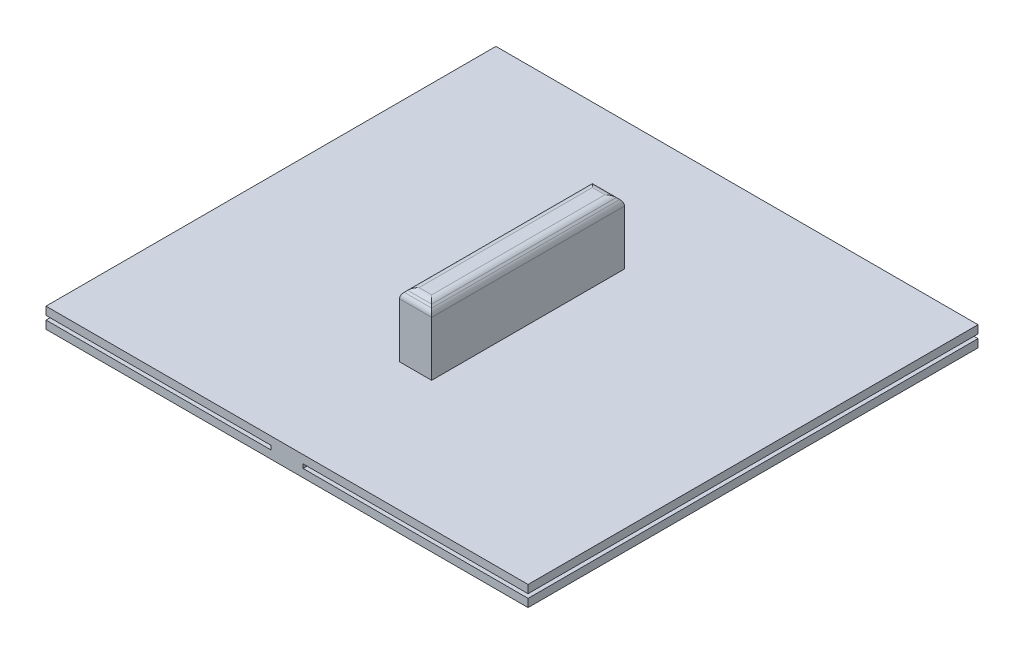
ISO-10303-21;
HEADER;
FILE_DESCRIPTION(('STEP AP214'),'2;1');
FILE_NAME('part.step','',(''),(''),'','','');
FILE_SCHEMA(('AUTOMOTIVE_DESIGN { 1 0 10303 214 1 1 1 1 }'));
ENDSEC;
DATA;
#1=APPLICATION_CONTEXT('core data for automotive mechanical design processes');
#2=APPLICATION_PROTOCOL_DEFINITION('international standard','automotive_design',2000,#1);
#3=PRODUCT_CONTEXT('',#1,'mechanical');
#4=PRODUCT('Part','Part','',(#3));
#5=PRODUCT_RELATED_PRODUCT_CATEGORY('part','',(#4));
#6=PRODUCT_DEFINITION_FORMATION('','',#4);
#7=PRODUCT_DEFINITION_CONTEXT('part definition',#1,'design');
#8=PRODUCT_DEFINITION('design','',#6,#7);
#9=PRODUCT_DEFINITION_SHAPE('','',#8);
#10=(LENGTH_UNIT() NAMED_UNIT(*) SI_UNIT(.MILLI.,.METRE.));
#11=(NAMED_UNIT(*) PLANE_ANGLE_UNIT() SI_UNIT($,.RADIAN.));
#12=(NAMED_UNIT(*) SI_UNIT($,.STERADIAN.) SOLID_ANGLE_UNIT());
#13=UNCERTAINTY_MEASURE_WITH_UNIT(LENGTH_MEASURE(1.E-05),#10,'distance_accuracy_value','');
#14=(GEOMETRIC_REPRESENTATION_CONTEXT(3) GLOBAL_UNCERTAINTY_ASSIGNED_CONTEXT((#13)) GLOBAL_UNIT_ASSIGNED_CONTEXT((#10,
#11,#12)) REPRESENTATION_CONTEXT('',''));
#15=CARTESIAN_POINT('',(0.,0.,0.));
#16=DIRECTION('',(0.,0.,1.));
#17=DIRECTION('',(1.,0.,0.));
#18=AXIS2_PLACEMENT_3D('',#15,#16,#17);
#19=CARTESIAN_POINT('',(-1.27,5.3975,-35.56));
#20=DIRECTION('',(-1.,0.,0.));
#21=DIRECTION('',(0.,-1.,0.));
#22=AXIS2_PLACEMENT_3D('',#19,#20,#21);
#23=PLANE('',#22);
#24=DIRECTION('',(0.,-1.,0.));
#25=VECTOR('',#24,1.);
#26=CARTESIAN_POINT('',(-1.27,5.3975,-10.16));
#27=LINE('',#26,#25);
#28=CARTESIAN_POINT('',(-1.27,4.62647438789308,-10.16));
#29=VERTEX_POINT('',#28);
#30=CARTESIAN_POINT('',(-1.27,0.3175,-10.16));
#31=VERTEX_POINT('',#30);
#32=EDGE_CURVE('E524',#29,#31,#27,.T.);
#33=ORIENTED_EDGE('',*,*,#32,.F.);
#34=DIRECTION('',(0.,0.,1.));
#35=VECTOR('',#34,1.);
#36=CARTESIAN_POINT('',(-1.27,4.62647438789308,-35.56));
#37=LINE('',#36,#35);
#38=CARTESIAN_POINT('',(-1.27,4.62647438789308,-25.4));
#39=VERTEX_POINT('',#38);
#40=EDGE_CURVE('E41',#29,#39,#37,.F.);
#41=ORIENTED_EDGE('',*,*,#40,.T.);
#42=DIRECTION('',(0.,1.,0.));
#43=VECTOR('',#42,1.);
#44=CARTESIAN_POINT('',(-1.27,0.3175,-25.4));
#45=LINE('',#44,#43);
#46=CARTESIAN_POINT('',(-1.27,0.3175,-25.4));
#47=VERTEX_POINT('',#46);
#48=EDGE_CURVE('E202',#47,#39,#45,.T.);
#49=ORIENTED_EDGE('',*,*,#48,.F.);
#50=DIRECTION('',(0.,0.,1.));
#51=VECTOR('',#50,1.);
#52=CARTESIAN_POINT('',(-1.27,0.3175,-35.56));
#53=LINE('',#52,#51);
#54=EDGE_CURVE('E201',#47,#31,#53,.T.);
#55=ORIENTED_EDGE('',*,*,#54,.T.);
#56=EDGE_LOOP('',(#33,#41,#49,#55));
#57=FACE_BOUND('',#56,.T.);
#58=ADVANCED_FACE('F32',(#57),#23,.T.);
#59=CARTESIAN_POINT('',(-1.27,5.3975,-35.56));
#60=DIRECTION('',(0.,1.,0.));
#61=DIRECTION('',(0.,0.,1.));
#62=AXIS2_PLACEMENT_3D('',#59,#60,#61);
#63=PLANE('',#62);
#64=DIRECTION('',(-1.,0.,0.));
#65=VECTOR('',#64,1.);
#66=CARTESIAN_POINT('',(-1.27,5.3975,-24.6289743878931));
#67=LINE('',#66,#65);
#68=CARTESIAN_POINT('',(0.49897438789308,5.3975,-24.6289743878931));
#69=VERTEX_POINT('',#68);
#70=CARTESIAN_POINT('',(-0.498974387893082,5.3975,-24.6289743878931));
#71=VERTEX_POINT('',#70);
#72=EDGE_CURVE('E232',#69,#71,#67,.T.);
#73=ORIENTED_EDGE('',*,*,#72,.T.);
#74=DIRECTION('',(0.,0.,-1.));
#75=VECTOR('',#74,1.);
#76=CARTESIAN_POINT('',(-0.498974387893082,5.3975,-35.56));
#77=LINE('',#76,#75);
#78=CARTESIAN_POINT('',(-0.498974387893082,5.3975,-10.9310256121069));
#79=VERTEX_POINT('',#78);
#80=EDGE_CURVE('E234',#71,#79,#77,.F.);
#81=ORIENTED_EDGE('',*,*,#80,.T.);
#82=DIRECTION('',(-1.,0.,0.));
#83=VECTOR('',#82,1.);
#84=CARTESIAN_POINT('',(-1.27,5.3975,-10.9310256121069));
#85=LINE('',#84,#83);
#86=CARTESIAN_POINT('',(0.49897438789308,5.3975,-10.9310256121069));
#87=VERTEX_POINT('',#86);
#88=EDGE_CURVE('E227',#79,#87,#85,.F.);
#89=ORIENTED_EDGE('',*,*,#88,.T.);
#90=DIRECTION('',(0.,0.,1.));
#91=VECTOR('',#90,1.);
#92=CARTESIAN_POINT('',(0.49897438789308,5.3975,-35.56));
#93=LINE('',#92,#91);
#94=EDGE_CURVE('E229',#87,#69,#93,.F.);
#95=ORIENTED_EDGE('',*,*,#94,.T.);
#96=EDGE_LOOP('',(#73,#81,#89,#95));
#97=FACE_BOUND('',#96,.T.);
#98=ADVANCED_FACE('F305',(#97),#63,.T.);
#99=CARTESIAN_POINT('',(1.27,0.3175,-35.56));
#100=DIRECTION('',(1.,0.,0.));
#101=DIRECTION('',(0.,1.,0.));
#102=AXIS2_PLACEMENT_3D('',#99,#100,#101);
#103=PLANE('',#102);
#104=DIRECTION('',(0.,-1.,0.));
#105=VECTOR('',#104,1.);
#106=CARTESIAN_POINT('',(1.27,0.3175,-25.4));
#107=LINE('',#106,#105);
#108=CARTESIAN_POINT('',(1.27,4.62647438789308,-25.4));
#109=VERTEX_POINT('',#108);
#110=CARTESIAN_POINT('',(1.27,0.3175,-25.4));
#111=VERTEX_POINT('',#110);
#112=EDGE_CURVE('E182',#109,#111,#107,.T.);
#113=ORIENTED_EDGE('',*,*,#112,.F.);
#114=DIRECTION('',(0.,0.,-1.));
#115=VECTOR('',#114,1.);
#116=CARTESIAN_POINT('',(1.27,4.62647438789308,-35.56));
#117=LINE('',#116,#115);
#118=CARTESIAN_POINT('',(1.27,4.62647438789308,-10.16));
#119=VERTEX_POINT('',#118);
#120=EDGE_CURVE('E11',#109,#119,#117,.F.);
#121=ORIENTED_EDGE('',*,*,#120,.T.);
#122=DIRECTION('',(0.,1.,0.));
#123=VECTOR('',#122,1.);
#124=CARTESIAN_POINT('',(1.27,5.3975,-10.16));
#125=LINE('',#124,#123);
#126=CARTESIAN_POINT('',(1.27,0.3175,-10.16));
#127=VERTEX_POINT('',#126);
#128=EDGE_CURVE('E205',#127,#119,#125,.T.);
#129=ORIENTED_EDGE('',*,*,#128,.F.);
#130=DIRECTION('',(0.,0.,1.));
#131=VECTOR('',#130,1.);
#132=CARTESIAN_POINT('',(1.27,0.3175,-35.56));
#133=LINE('',#132,#131);
#134=EDGE_CURVE('E198',#111,#127,#133,.T.);
#135=ORIENTED_EDGE('',*,*,#134,.F.);
#136=EDGE_LOOP('',(#113,#121,#129,#135));
#137=FACE_BOUND('',#136,.T.);
#138=ADVANCED_FACE('F204',(#137),#103,.T.);
#139=CARTESIAN_POINT('',(19.05,-0.3175,-35.56));
#140=DIRECTION('',(1.,0.,0.));
#141=DIRECTION('',(0.,0.,-1.));
#142=AXIS2_PLACEMENT_3D('',#139,#140,#141);
#143=PLANE('',#142);
#144=DIRECTION('',(0.,1.,0.));
#145=VECTOR('',#144,1.);
#146=CARTESIAN_POINT('',(19.05,-0.3175,0.));
#147=LINE('',#146,#145);
#148=CARTESIAN_POINT('',(19.05,-0.3175,0.));
#149=VERTEX_POINT('',#148);
#150=CARTESIAN_POINT('',(19.05,0.3175,0.));
#151=VERTEX_POINT('',#150);
#152=EDGE_CURVE('E423',#149,#151,#147,.T.);
#153=ORIENTED_EDGE('',*,*,#152,.F.);
#154=DIRECTION('',(0.,0.,1.));
#155=VECTOR('',#154,1.);
#156=CARTESIAN_POINT('',(19.05,-0.3175,-35.56));
#157=LINE('',#156,#155);
#158=CARTESIAN_POINT('',(19.05,-0.3175,-35.56));
#159=VERTEX_POINT('',#158);
#160=EDGE_CURVE('E457',#159,#149,#157,.T.);
#161=ORIENTED_EDGE('',*,*,#160,.F.);
#162=DIRECTION('',(0.,1.,0.));
#163=VECTOR('',#162,1.);
#164=CARTESIAN_POINT('',(19.05,-0.3175,-35.56));
#165=LINE('',#164,#163);
#166=CARTESIAN_POINT('',(19.05,0.3175,-35.56));
#167=VERTEX_POINT('',#166);
#168=EDGE_CURVE('E206',#159,#167,#165,.T.);
#169=ORIENTED_EDGE('',*,*,#168,.T.);
#170=DIRECTION('',(0.,0.,1.));
#171=VECTOR('',#170,1.);
#172=CARTESIAN_POINT('',(19.05,0.3175,-35.56));
#173=LINE('',#172,#171);
#174=EDGE_CURVE('E230',#167,#151,#173,.T.);
#175=ORIENTED_EDGE('',*,*,#174,.T.);
#176=EDGE_LOOP('',(#153,#161,#169,#175));
#177=FACE_BOUND('',#176,.T.);
#178=ADVANCED_FACE('F336',(#177),#143,.T.);
#179=CARTESIAN_POINT('',(1.27,-0.3175,-35.56));
#180=DIRECTION('',(0.,-1.,0.));
#181=DIRECTION('',(0.,0.,-1.));
#182=AXIS2_PLACEMENT_3D('',#179,#180,#181);
#183=PLANE('',#182);
#184=DIRECTION('',(1.,0.,0.));
#185=VECTOR('',#184,1.);
#186=CARTESIAN_POINT('',(1.27,-0.3175,0.));
#187=LINE('',#186,#185);
#188=CARTESIAN_POINT('',(1.27,-0.3175,0.));
#189=VERTEX_POINT('',#188);
#190=EDGE_CURVE('E452',#189,#149,#187,.T.);
#191=ORIENTED_EDGE('',*,*,#190,.F.);
#192=DIRECTION('',(0.,0.,1.));
#193=VECTOR('',#192,1.);
#194=CARTESIAN_POINT('',(1.27,-0.3175,-35.56));
#195=LINE('',#194,#193);
#196=CARTESIAN_POINT('',(1.27,-0.3175,-35.56));
#197=VERTEX_POINT('',#196);
#198=EDGE_CURVE('E459',#197,#189,#195,.T.);
#199=ORIENTED_EDGE('',*,*,#198,.F.);
#200=DIRECTION('',(1.,0.,0.));
#201=VECTOR('',#200,1.);
#202=CARTESIAN_POINT('',(1.27,-0.3175,-35.56));
#203=LINE('',#202,#201);
#204=EDGE_CURVE('E211',#197,#159,#203,.T.);
#205=ORIENTED_EDGE('',*,*,#204,.T.);
#206=ORIENTED_EDGE('',*,*,#160,.T.);
#207=EDGE_LOOP('',(#191,#199,#205,#206));
#208=FACE_BOUND('',#207,.T.);
#209=ADVANCED_FACE('F365',(#208),#183,.T.);
#210=CARTESIAN_POINT('',(1.27,-0.635,-35.56));
#211=DIRECTION('',(1.,0.,0.));
#212=DIRECTION('',(0.,1.,0.));
#213=AXIS2_PLACEMENT_3D('',#210,#211,#212);
#214=PLANE('',#213);
#215=DIRECTION('',(0.,1.,0.));
#216=VECTOR('',#215,1.);
#217=CARTESIAN_POINT('',(1.27,-0.635,0.));
#218=LINE('',#217,#216);
#219=CARTESIAN_POINT('',(1.27,-0.635,0.));
#220=VERTEX_POINT('',#219);
#221=EDGE_CURVE('E449',#220,#189,#218,.T.);
#222=ORIENTED_EDGE('',*,*,#221,.F.);
#223=DIRECTION('',(0.,0.,1.));
#224=VECTOR('',#223,1.);
#225=CARTESIAN_POINT('',(1.27,-0.635,-35.56));
#226=LINE('',#225,#224);
#227=CARTESIAN_POINT('',(1.27,-0.635,-35.56));
#228=VERTEX_POINT('',#227);
#229=EDGE_CURVE('E461',#228,#220,#226,.T.);
#230=ORIENTED_EDGE('',*,*,#229,.F.);
#231=DIRECTION('',(0.,1.,0.));
#232=VECTOR('',#231,1.);
#233=CARTESIAN_POINT('',(1.27,-0.635,-35.56));
#234=LINE('',#233,#232);
#235=EDGE_CURVE('E503',#228,#197,#234,.T.);
#236=ORIENTED_EDGE('',*,*,#235,.T.);
#237=ORIENTED_EDGE('',*,*,#198,.T.);
#238=EDGE_LOOP('',(#222,#230,#236,#237));
#239=FACE_BOUND('',#238,.T.);
#240=ADVANCED_FACE('F369',(#239),#214,.T.);
#241=CARTESIAN_POINT('',(1.27,-0.635,-35.56));
#242=DIRECTION('',(0.,1.,0.));
#243=DIRECTION('',(0.,0.,1.));
#244=AXIS2_PLACEMENT_3D('',#241,#242,#243);
#245=PLANE('',#244);
#246=DIRECTION('',(-1.,0.,0.));
#247=VECTOR('',#246,1.);
#248=CARTESIAN_POINT('',(1.27,-0.635,0.));
#249=LINE('',#248,#247);
#250=CARTESIAN_POINT('',(19.05,-0.635,0.));
#251=VERTEX_POINT('',#250);
#252=EDGE_CURVE('E446',#251,#220,#249,.T.);
#253=ORIENTED_EDGE('',*,*,#252,.F.);
#254=DIRECTION('',(0.,0.,1.));
#255=VECTOR('',#254,1.);
#256=CARTESIAN_POINT('',(19.05,-0.635,-35.56));
#257=LINE('',#256,#255);
#258=CARTESIAN_POINT('',(19.05,-0.635,-35.56));
#259=VERTEX_POINT('',#258);
#260=EDGE_CURVE('E463',#259,#251,#257,.T.);
#261=ORIENTED_EDGE('',*,*,#260,.F.);
#262=DIRECTION('',(-1.,0.,0.));
#263=VECTOR('',#262,1.);
#264=CARTESIAN_POINT('',(1.27,-0.635,-35.56));
#265=LINE('',#264,#263);
#266=EDGE_CURVE('E500',#259,#228,#265,.T.);
#267=ORIENTED_EDGE('',*,*,#266,.T.);
#268=ORIENTED_EDGE('',*,*,#229,.T.);
#269=EDGE_LOOP('',(#253,#261,#267,#268));
#270=FACE_BOUND('',#269,.T.);
#271=ADVANCED_FACE('F373',(#270),#245,.T.);
#272=CARTESIAN_POINT('',(19.05,-1.27,-35.56));
#273=DIRECTION('',(1.,0.,0.));
#274=DIRECTION('',(0.,0.,-1.));
#275=AXIS2_PLACEMENT_3D('',#272,#273,#274);
#276=PLANE('',#275);
#277=DIRECTION('',(0.,1.,0.));
#278=VECTOR('',#277,1.);
#279=CARTESIAN_POINT('',(19.05,-1.27,0.));
#280=LINE('',#279,#278);
#281=CARTESIAN_POINT('',(19.05,-1.27,0.));
#282=VERTEX_POINT('',#281);
#283=EDGE_CURVE('E443',#282,#251,#280,.T.);
#284=ORIENTED_EDGE('',*,*,#283,.F.);
#285=DIRECTION('',(0.,0.,1.));
#286=VECTOR('',#285,1.);
#287=CARTESIAN_POINT('',(19.05,-1.27,-35.56));
#288=LINE('',#287,#286);
#289=CARTESIAN_POINT('',(19.05,-1.27,-35.56));
#290=VERTEX_POINT('',#289);
#291=EDGE_CURVE('E465',#290,#282,#288,.T.);
#292=ORIENTED_EDGE('',*,*,#291,.F.);
#293=DIRECTION('',(0.,1.,0.));
#294=VECTOR('',#293,1.);
#295=CARTESIAN_POINT('',(19.05,-1.27,-35.56));
#296=LINE('',#295,#294);
#297=EDGE_CURVE('E497',#290,#259,#296,.T.);
#298=ORIENTED_EDGE('',*,*,#297,.T.);
#299=ORIENTED_EDGE('',*,*,#260,.T.);
#300=EDGE_LOOP('',(#284,#292,#298,#299));
#301=FACE_BOUND('',#300,.T.);
#302=ADVANCED_FACE('F377',(#301),#276,.T.);
#303=CARTESIAN_POINT('',(-19.05,-1.27,-35.56));
#304=DIRECTION('',(0.,-1.,0.));
#305=DIRECTION('',(0.,0.,-1.));
#306=AXIS2_PLACEMENT_3D('',#303,#304,#305);
#307=PLANE('',#306);
#308=DIRECTION('',(1.,0.,0.));
#309=VECTOR('',#308,1.);
#310=CARTESIAN_POINT('',(-19.05,-1.27,0.));
#311=LINE('',#310,#309);
#312=CARTESIAN_POINT('',(-19.05,-1.27,0.));
#313=VERTEX_POINT('',#312);
#314=EDGE_CURVE('E440',#313,#282,#311,.T.);
#315=ORIENTED_EDGE('',*,*,#314,.F.);
#316=DIRECTION('',(0.,0.,1.));
#317=VECTOR('',#316,1.);
#318=CARTESIAN_POINT('',(-19.05,-1.27,-35.56));
#319=LINE('',#318,#317);
#320=CARTESIAN_POINT('',(-19.05,-1.27,-35.56));
#321=VERTEX_POINT('',#320);
#322=EDGE_CURVE('E467',#321,#313,#319,.T.);
#323=ORIENTED_EDGE('',*,*,#322,.F.);
#324=DIRECTION('',(1.,0.,0.));
#325=VECTOR('',#324,1.);
#326=CARTESIAN_POINT('',(-19.05,-1.27,-35.56));
#327=LINE('',#326,#325);
#328=EDGE_CURVE('E494',#321,#290,#327,.T.);
#329=ORIENTED_EDGE('',*,*,#328,.T.);
#330=ORIENTED_EDGE('',*,*,#291,.T.);
#331=EDGE_LOOP('',(#315,#323,#329,#330));
#332=FACE_BOUND('',#331,.T.);
#333=ADVANCED_FACE('F381',(#332),#307,.T.);
#334=CARTESIAN_POINT('',(-19.05,-1.27,-35.56));
#335=DIRECTION('',(-1.,0.,0.));
#336=DIRECTION('',(0.,0.,1.));
#337=AXIS2_PLACEMENT_3D('',#334,#335,#336);
#338=PLANE('',#337);
#339=DIRECTION('',(0.,-1.,0.));
#340=VECTOR('',#339,1.);
#341=CARTESIAN_POINT('',(-19.05,-1.27,0.));
#342=LINE('',#341,#340);
#343=CARTESIAN_POINT('',(-19.05,-0.635,0.));
#344=VERTEX_POINT('',#343);
#345=EDGE_CURVE('E437',#344,#313,#342,.T.);
#346=ORIENTED_EDGE('',*,*,#345,.F.);
#347=DIRECTION('',(0.,0.,1.));
#348=VECTOR('',#347,1.);
#349=CARTESIAN_POINT('',(-19.05,-0.635,-35.56));
#350=LINE('',#349,#348);
#351=CARTESIAN_POINT('',(-19.05,-0.635,-35.56));
#352=VERTEX_POINT('',#351);
#353=EDGE_CURVE('E469',#352,#344,#350,.T.);
#354=ORIENTED_EDGE('',*,*,#353,.F.);
#355=DIRECTION('',(0.,-1.,0.));
#356=VECTOR('',#355,1.);
#357=CARTESIAN_POINT('',(-19.05,-1.27,-35.56));
#358=LINE('',#357,#356);
#359=EDGE_CURVE('E491',#352,#321,#358,.T.);
#360=ORIENTED_EDGE('',*,*,#359,.T.);
#361=ORIENTED_EDGE('',*,*,#322,.T.);
#362=EDGE_LOOP('',(#346,#354,#360,#361));
#363=FACE_BOUND('',#362,.T.);
#364=ADVANCED_FACE('F385',(#363),#338,.T.);
#365=CARTESIAN_POINT('',(-19.05,-0.635,-35.56));
#366=DIRECTION('',(0.,1.,0.));
#367=DIRECTION('',(0.,0.,1.));
#368=AXIS2_PLACEMENT_3D('',#365,#366,#367);
#369=PLANE('',#368);
#370=DIRECTION('',(-1.,0.,0.));
#371=VECTOR('',#370,1.);
#372=CARTESIAN_POINT('',(-19.05,-0.635,0.));
#373=LINE('',#372,#371);
#374=CARTESIAN_POINT('',(-1.27,-0.635,0.));
#375=VERTEX_POINT('',#374);
#376=EDGE_CURVE('E434',#375,#344,#373,.T.);
#377=ORIENTED_EDGE('',*,*,#376,.F.);
#378=DIRECTION('',(0.,0.,1.));
#379=VECTOR('',#378,1.);
#380=CARTESIAN_POINT('',(-1.27,-0.635,-35.56));
#381=LINE('',#380,#379);
#382=CARTESIAN_POINT('',(-1.27,-0.635,-35.56));
#383=VERTEX_POINT('',#382);
#384=EDGE_CURVE('E471',#383,#375,#381,.T.);
#385=ORIENTED_EDGE('',*,*,#384,.F.);
#386=DIRECTION('',(-1.,0.,0.));
#387=VECTOR('',#386,1.);
#388=CARTESIAN_POINT('',(-19.05,-0.635,-35.56));
#389=LINE('',#388,#387);
#390=EDGE_CURVE('E488',#383,#352,#389,.T.);
#391=ORIENTED_EDGE('',*,*,#390,.T.);
#392=ORIENTED_EDGE('',*,*,#353,.T.);
#393=EDGE_LOOP('',(#377,#385,#391,#392));
#394=FACE_BOUND('',#393,.T.);
#395=ADVANCED_FACE('F389',(#394),#369,.T.);
#396=CARTESIAN_POINT('',(-1.27,-0.635,-35.56));
#397=DIRECTION('',(-1.,0.,0.));
#398=DIRECTION('',(0.,-1.,0.));
#399=AXIS2_PLACEMENT_3D('',#396,#397,#398);
#400=PLANE('',#399);
#401=DIRECTION('',(0.,-1.,0.));
#402=VECTOR('',#401,1.);
#403=CARTESIAN_POINT('',(-1.27,-0.635,0.));
#404=LINE('',#403,#402);
#405=CARTESIAN_POINT('',(-1.27,-0.3175,0.));
#406=VERTEX_POINT('',#405);
#407=EDGE_CURVE('E431',#406,#375,#404,.T.);
#408=ORIENTED_EDGE('',*,*,#407,.F.);
#409=DIRECTION('',(0.,0.,1.));
#410=VECTOR('',#409,1.);
#411=CARTESIAN_POINT('',(-1.27,-0.3175,-35.56));
#412=LINE('',#411,#410);
#413=CARTESIAN_POINT('',(-1.27,-0.3175,-35.56));
#414=VERTEX_POINT('',#413);
#415=EDGE_CURVE('E473',#414,#406,#412,.T.);
#416=ORIENTED_EDGE('',*,*,#415,.F.);
#417=DIRECTION('',(0.,-1.,0.));
#418=VECTOR('',#417,1.);
#419=CARTESIAN_POINT('',(-1.27,-0.635,-35.56));
#420=LINE('',#419,#418);
#421=EDGE_CURVE('E485',#414,#383,#420,.T.);
#422=ORIENTED_EDGE('',*,*,#421,.T.);
#423=ORIENTED_EDGE('',*,*,#384,.T.);
#424=EDGE_LOOP('',(#408,#416,#422,#423));
#425=FACE_BOUND('',#424,.T.);
#426=ADVANCED_FACE('F393',(#425),#400,.T.);
#427=CARTESIAN_POINT('',(-1.27,-0.3175,-35.56));
#428=DIRECTION('',(0.,-1.,0.));
#429=DIRECTION('',(0.,0.,-1.));
#430=AXIS2_PLACEMENT_3D('',#427,#428,#429);
#431=PLANE('',#430);
#432=DIRECTION('',(1.,0.,0.));
#433=VECTOR('',#432,1.);
#434=CARTESIAN_POINT('',(-1.27,-0.3175,0.));
#435=LINE('',#434,#433);
#436=CARTESIAN_POINT('',(-19.05,-0.3175,0.));
#437=VERTEX_POINT('',#436);
#438=EDGE_CURVE('E417',#437,#406,#435,.T.);
#439=ORIENTED_EDGE('',*,*,#438,.F.);
#440=DIRECTION('',(0.,0.,1.));
#441=VECTOR('',#440,1.);
#442=CARTESIAN_POINT('',(-19.05,-0.3175,-35.56));
#443=LINE('',#442,#441);
#444=CARTESIAN_POINT('',(-19.05,-0.3175,-35.56));
#445=VERTEX_POINT('',#444);
#446=EDGE_CURVE('E414',#445,#437,#443,.T.);
#447=ORIENTED_EDGE('',*,*,#446,.F.);
#448=DIRECTION('',(1.,0.,0.));
#449=VECTOR('',#448,1.);
#450=CARTESIAN_POINT('',(-1.27,-0.3175,-35.56));
#451=LINE('',#450,#449);
#452=EDGE_CURVE('E479',#445,#414,#451,.T.);
#453=ORIENTED_EDGE('',*,*,#452,.T.);
#454=ORIENTED_EDGE('',*,*,#415,.T.);
#455=EDGE_LOOP('',(#439,#447,#453,#454));
#456=FACE_BOUND('',#455,.T.);
#457=ADVANCED_FACE('F397',(#456),#431,.T.);
#458=CARTESIAN_POINT('',(-19.05,-0.3175,-35.56));
#459=DIRECTION('',(-1.,0.,0.));
#460=DIRECTION('',(0.,0.,1.));
#461=AXIS2_PLACEMENT_3D('',#458,#459,#460);
#462=PLANE('',#461);
#463=DIRECTION('',(0.,-1.,0.));
#464=VECTOR('',#463,1.);
#465=CARTESIAN_POINT('',(-19.05,-0.3175,0.));
#466=LINE('',#465,#464);
#467=CARTESIAN_POINT('',(-19.05,0.3175,0.));
#468=VERTEX_POINT('',#467);
#469=EDGE_CURVE('E410',#468,#437,#466,.T.);
#470=ORIENTED_EDGE('',*,*,#469,.F.);
#471=DIRECTION('',(0.,0.,1.));
#472=VECTOR('',#471,1.);
#473=CARTESIAN_POINT('',(-19.05,0.3175,-35.56));
#474=LINE('',#473,#472);
#475=CARTESIAN_POINT('',(-19.05,0.3175,-35.56));
#476=VERTEX_POINT('',#475);
#477=EDGE_CURVE('E208',#476,#468,#474,.T.);
#478=ORIENTED_EDGE('',*,*,#477,.F.);
#479=DIRECTION('',(0.,-1.,0.));
#480=VECTOR('',#479,1.);
#481=CARTESIAN_POINT('',(-19.05,-0.3175,-35.56));
#482=LINE('',#481,#480);
#483=EDGE_CURVE('E477',#476,#445,#482,.T.);
#484=ORIENTED_EDGE('',*,*,#483,.T.);
#485=ORIENTED_EDGE('',*,*,#446,.T.);
#486=EDGE_LOOP('',(#470,#478,#484,#485));
#487=FACE_BOUND('',#486,.T.);
#488=ADVANCED_FACE('F400',(#487),#462,.T.);
#489=CARTESIAN_POINT('',(-1.27,0.3175,-35.56));
#490=DIRECTION('',(0.,1.,0.));
#491=DIRECTION('',(0.,0.,1.));
#492=AXIS2_PLACEMENT_3D('',#489,#490,#491);
#493=PLANE('',#492);
#494=DIRECTION('',(-1.,0.,0.));
#495=VECTOR('',#494,1.);
#496=CARTESIAN_POINT('',(1.27,0.3175,-25.4));
#497=LINE('',#496,#495);
#498=EDGE_CURVE('E186',#111,#47,#497,.T.);
#499=ORIENTED_EDGE('',*,*,#498,.F.);
#500=ORIENTED_EDGE('',*,*,#134,.T.);
#501=DIRECTION('',(1.,0.,0.));
#502=VECTOR('',#501,1.);
#503=CARTESIAN_POINT('',(-1.27,0.3175,-10.16));
#504=LINE('',#503,#502);
#505=EDGE_CURVE('E426',#31,#127,#504,.T.);
#506=ORIENTED_EDGE('',*,*,#505,.F.);
#507=ORIENTED_EDGE('',*,*,#54,.F.);
#508=EDGE_LOOP('',(#499,#500,#506,#507));
#509=FACE_BOUND('',#508,.T.);
#510=DIRECTION('',(-1.,0.,0.));
#511=VECTOR('',#510,1.);
#512=CARTESIAN_POINT('',(-1.27,0.3175,0.));
#513=LINE('',#512,#511);
#514=EDGE_CURVE('E418',#151,#468,#513,.T.);
#515=ORIENTED_EDGE('',*,*,#514,.F.);
#516=ORIENTED_EDGE('',*,*,#174,.F.);
#517=DIRECTION('',(-1.,0.,0.));
#518=VECTOR('',#517,1.);
#519=CARTESIAN_POINT('',(19.05,0.3175,-35.56));
#520=LINE('',#519,#518);
#521=EDGE_CURVE('E455',#167,#476,#520,.T.);
#522=ORIENTED_EDGE('',*,*,#521,.T.);
#523=ORIENTED_EDGE('',*,*,#477,.T.);
#524=EDGE_LOOP('',(#515,#516,#522,#523));
#525=FACE_BOUND('',#524,.T.);
#526=ADVANCED_FACE('F195',(#509,#525),#493,.T.);
#527=CARTESIAN_POINT('',(0.,0.,-35.56));
#528=DIRECTION('',(0.,0.,-1.));
#529=DIRECTION('',(-1.,0.,0.));
#530=AXIS2_PLACEMENT_3D('',#527,#528,#529);
#531=PLANE('',#530);
#532=ORIENTED_EDGE('',*,*,#483,.F.);
#533=ORIENTED_EDGE('',*,*,#521,.F.);
#534=ORIENTED_EDGE('',*,*,#168,.F.);
#535=ORIENTED_EDGE('',*,*,#204,.F.);
#536=ORIENTED_EDGE('',*,*,#235,.F.);
#537=ORIENTED_EDGE('',*,*,#266,.F.);
#538=ORIENTED_EDGE('',*,*,#297,.F.);
#539=ORIENTED_EDGE('',*,*,#328,.F.);
#540=ORIENTED_EDGE('',*,*,#359,.F.);
#541=ORIENTED_EDGE('',*,*,#390,.F.);
#542=ORIENTED_EDGE('',*,*,#421,.F.);
#543=ORIENTED_EDGE('',*,*,#452,.F.);
#544=EDGE_LOOP('',(#532,#533,#534,#535,#536,#537,#538,#539,#540,#541,#542,#543));
#545=FACE_BOUND('',#544,.T.);
#546=ADVANCED_FACE('F356',(#545),#531,.T.);
#547=CARTESIAN_POINT('',(0.,0.,0.));
#548=DIRECTION('',(0.,0.,-1.));
#549=DIRECTION('',(-1.,0.,0.));
#550=AXIS2_PLACEMENT_3D('',#547,#548,#549);
#551=PLANE('',#550);
#552=ORIENTED_EDGE('',*,*,#152,.T.);
#553=ORIENTED_EDGE('',*,*,#514,.T.);
#554=ORIENTED_EDGE('',*,*,#469,.T.);
#555=ORIENTED_EDGE('',*,*,#438,.T.);
#556=ORIENTED_EDGE('',*,*,#407,.T.);
#557=ORIENTED_EDGE('',*,*,#376,.T.);
#558=ORIENTED_EDGE('',*,*,#345,.T.);
#559=ORIENTED_EDGE('',*,*,#314,.T.);
#560=ORIENTED_EDGE('',*,*,#283,.T.);
#561=ORIENTED_EDGE('',*,*,#252,.T.);
#562=ORIENTED_EDGE('',*,*,#221,.T.);
#563=ORIENTED_EDGE('',*,*,#190,.T.);
#564=EDGE_LOOP('',(#552,#553,#554,#555,#556,#557,#558,#559,#560,#561,#562,#563));
#565=FACE_BOUND('',#564,.T.);
#566=ADVANCED_FACE('F353',(#565),#551,.F.);
#567=CARTESIAN_POINT('',(0.,0.,-10.16));
#568=DIRECTION('',(0.,0.,1.));
#569=DIRECTION('',(1.,0.,0.));
#570=AXIS2_PLACEMENT_3D('',#567,#568,#569);
#571=PLANE('',#570);
#572=ORIENTED_EDGE('',*,*,#128,.T.);
#573=DIRECTION('',(1.,0.,0.));
#574=VECTOR('',#573,1.);
#575=CARTESIAN_POINT('',(0.,4.62647438789308,-10.16));
#576=LINE('',#575,#574);
#577=EDGE_CURVE('E49',#119,#29,#576,.F.);
#578=ORIENTED_EDGE('',*,*,#577,.T.);
#579=ORIENTED_EDGE('',*,*,#32,.T.);
#580=ORIENTED_EDGE('',*,*,#505,.T.);
#581=EDGE_LOOP('',(#572,#578,#579,#580));
#582=FACE_BOUND('',#581,.T.);
#583=ADVANCED_FACE('F348',(#582),#571,.T.);
#584=CARTESIAN_POINT('',(0.,0.,-25.4));
#585=DIRECTION('',(0.,0.,1.));
#586=DIRECTION('',(1.,0.,0.));
#587=AXIS2_PLACEMENT_3D('',#584,#585,#586);
#588=PLANE('',#587);
#589=ORIENTED_EDGE('',*,*,#48,.T.);
#590=DIRECTION('',(1.,0.,0.));
#591=VECTOR('',#590,1.);
#592=CARTESIAN_POINT('',(1.27,4.62647438789308,-25.4));
#593=LINE('',#592,#591);
#594=EDGE_CURVE('E189',#39,#109,#593,.T.);
#595=ORIENTED_EDGE('',*,*,#594,.T.);
#596=ORIENTED_EDGE('',*,*,#112,.T.);
#597=ORIENTED_EDGE('',*,*,#498,.T.);
#598=EDGE_LOOP('',(#589,#595,#596,#597));
#599=FACE_BOUND('',#598,.T.);
#600=ADVANCED_FACE('F185',(#599),#588,.F.);
#601=CARTESIAN_POINT('',(-0.761999999999999,5.3975,-35.56));
#602=DIRECTION('',(0.707106781186553,-0.707106781186542,0.));
#603=DIRECTION('',(0.,0.,1.));
#604=AXIS2_PLACEMENT_3D('',#601,#602,#603);
#605=PLANE('',#604);
#606=DIRECTION('',(0.577350269189622,0.577350269189631,-0.577350269189625));
#607=VECTOR('',#606,1.);
#608=CARTESIAN_POINT('',(7.53533333333326,13.6948333333334,-18.9653333333333));
#609=LINE('',#608,#607);
#610=CARTESIAN_POINT('',(-0.947987193946541,5.21151280605346,-10.4820128060535));
#611=VERTEX_POINT('',#610);
#612=CARTESIAN_POINT('',(-1.08401280605346,5.07548719394653,-10.3459871939465));
#613=VERTEX_POINT('',#612);
#614=EDGE_CURVE('E222',#611,#613,#609,.F.);
#615=ORIENTED_EDGE('',*,*,#614,.F.);
#616=DIRECTION('',(0.,0.,1.));
#617=VECTOR('',#616,1.);
#618=CARTESIAN_POINT('',(-0.947987193946542,5.21151280605346,-35.56));
#619=LINE('',#618,#617);
#620=CARTESIAN_POINT('',(-0.947987193946542,5.21151280605346,-25.0779871939465));
#621=VERTEX_POINT('',#620);
#622=EDGE_CURVE('E239',#611,#621,#619,.F.);
#623=ORIENTED_EDGE('',*,*,#622,.T.);
#624=DIRECTION('',(-0.577350269189623,-0.577350269189631,-0.577350269189623));
#625=VECTOR('',#624,1.);
#626=CARTESIAN_POINT('',(-0.846666666666671,5.31283333333333,-24.9766666666667));
#627=LINE('',#626,#625);
#628=CARTESIAN_POINT('',(-1.08401280605346,5.07548719394653,-25.2140128060535));
#629=VERTEX_POINT('',#628);
#630=EDGE_CURVE('E191',#629,#621,#627,.F.);
#631=ORIENTED_EDGE('',*,*,#630,.F.);
#632=DIRECTION('',(0.,0.,-1.));
#633=VECTOR('',#632,1.);
#634=CARTESIAN_POINT('',(-1.08401280605346,5.07548719394653,-35.56));
#635=LINE('',#634,#633);
#636=EDGE_CURVE('E237',#629,#613,#635,.F.);
#637=ORIENTED_EDGE('',*,*,#636,.T.);
#638=EDGE_LOOP('',(#615,#623,#631,#637));
#639=FACE_BOUND('',#638,.T.);
#640=ADVANCED_FACE('F312',(#639),#605,.F.);
#641=CARTESIAN_POINT('',(0.,4.88949999999999,-25.4));
#642=DIRECTION('',(0.,0.707106781186543,-0.707106781186552));
#643=DIRECTION('',(-1.,0.,0.));
#644=AXIS2_PLACEMENT_3D('',#641,#642,#643);
#645=PLANE('',#644);
#646=ORIENTED_EDGE('',*,*,#630,.T.);
#647=DIRECTION('',(-1.,0.,0.));
#648=VECTOR('',#647,1.);
#649=CARTESIAN_POINT('',(0.,5.21151280605346,-25.0779871939465));
#650=LINE('',#649,#648);
#651=CARTESIAN_POINT('',(0.947987193946541,5.21151280605346,-25.0779871939465));
#652=VERTEX_POINT('',#651);
#653=EDGE_CURVE('E245',#621,#652,#650,.F.);
#654=ORIENTED_EDGE('',*,*,#653,.T.);
#655=DIRECTION('',(-0.577350269189623,0.577350269189631,0.577350269189623));
#656=VECTOR('',#655,1.);
#657=CARTESIAN_POINT('',(0.84666666666667,5.31283333333333,-24.9766666666667));
#658=LINE('',#657,#656);
#659=CARTESIAN_POINT('',(1.08401280605346,5.07548719394653,-25.2140128060535));
#660=VERTEX_POINT('',#659);
#661=EDGE_CURVE('E218',#660,#652,#658,.T.);
#662=ORIENTED_EDGE('',*,*,#661,.F.);
#663=DIRECTION('',(1.,0.,0.));
#664=VECTOR('',#663,1.);
#665=CARTESIAN_POINT('',(-1.27,5.07548719394653,-25.2140128060535));
#666=LINE('',#665,#664);
#667=EDGE_CURVE('E242',#660,#629,#666,.F.);
#668=ORIENTED_EDGE('',*,*,#667,.T.);
#669=EDGE_LOOP('',(#646,#654,#662,#668));
#670=FACE_BOUND('',#669,.T.);
#671=ADVANCED_FACE('F341',(#670),#645,.T.);
#672=CARTESIAN_POINT('',(0.,4.88949999999999,-10.16));
#673=DIRECTION('',(0.,-0.707106781186544,-0.707106781186551));
#674=DIRECTION('',(-1.,0.,0.));
#675=AXIS2_PLACEMENT_3D('',#672,#673,#674);
#676=PLANE('',#675);
#677=DIRECTION('',(-0.577350269189622,0.577350269189631,-0.577350269189625));
#678=VECTOR('',#677,1.);
#679=CARTESIAN_POINT('',(0.846666666666671,5.31283333333333,-10.5833333333333));
#680=LINE('',#679,#678);
#681=CARTESIAN_POINT('',(0.947987193946539,5.21151280605346,-10.4820128060535));
#682=VERTEX_POINT('',#681);
#683=CARTESIAN_POINT('',(1.08401280605346,5.07548719394653,-10.3459871939465));
#684=VERTEX_POINT('',#683);
#685=EDGE_CURVE('E215',#682,#684,#680,.F.);
#686=ORIENTED_EDGE('',*,*,#685,.F.);
#687=DIRECTION('',(1.,0.,0.));
#688=VECTOR('',#687,1.);
#689=CARTESIAN_POINT('',(0.,5.21151280605346,-10.4820128060535));
#690=LINE('',#689,#688);
#691=EDGE_CURVE('E253',#682,#611,#690,.F.);
#692=ORIENTED_EDGE('',*,*,#691,.T.);
#693=ORIENTED_EDGE('',*,*,#614,.T.);
#694=DIRECTION('',(-1.,0.,0.));
#695=VECTOR('',#694,1.);
#696=CARTESIAN_POINT('',(0.,5.07548719394653,-10.3459871939465));
#697=LINE('',#696,#695);
#698=EDGE_CURVE('E251',#613,#684,#697,.F.);
#699=ORIENTED_EDGE('',*,*,#698,.T.);
#700=EDGE_LOOP('',(#686,#692,#693,#699));
#701=FACE_BOUND('',#700,.T.);
#702=ADVANCED_FACE('F286',(#701),#676,.F.);
#703=CARTESIAN_POINT('',(1.27,4.88949999999999,-35.56));
#704=DIRECTION('',(-0.707106781186553,-0.707106781186542,0.));
#705=DIRECTION('',(0.,0.,1.));
#706=AXIS2_PLACEMENT_3D('',#703,#704,#705);
#707=PLANE('',#706);
#708=ORIENTED_EDGE('',*,*,#661,.T.);
#709=DIRECTION('',(0.,0.,-1.));
#710=VECTOR('',#709,1.);
#711=CARTESIAN_POINT('',(0.947987193946541,5.21151280605346,-35.56));
#712=LINE('',#711,#710);
#713=EDGE_CURVE('E249',#652,#682,#712,.F.);
#714=ORIENTED_EDGE('',*,*,#713,.T.);
#715=ORIENTED_EDGE('',*,*,#685,.T.);
#716=DIRECTION('',(0.,0.,1.));
#717=VECTOR('',#716,1.);
#718=CARTESIAN_POINT('',(1.08401280605346,5.07548719394653,-35.56));
#719=LINE('',#718,#717);
#720=EDGE_CURVE('E247',#684,#660,#719,.F.);
#721=ORIENTED_EDGE('',*,*,#720,.T.);
#722=EDGE_LOOP('',(#708,#714,#715,#721));
#723=FACE_BOUND('',#722,.T.);
#724=ADVANCED_FACE('F290',(#723),#707,.F.);
#725=CARTESIAN_POINT('',(0.49897438789308,4.7625,-35.56));
#726=DIRECTION('',(0.,0.,1.));
#727=DIRECTION('',(1.,0.,0.));
#728=AXIS2_PLACEMENT_3D('',#725,#726,#727);
#729=CYLINDRICAL_SURFACE('',#728,0.635);
#730=CARTESIAN_POINT('',(0.49897438789308,4.7625,-10.9310256121069));
#731=DIRECTION('',(-0.707106781186547,0.,0.707106781186547));
#732=DIRECTION('',(-0.707106781186547,0.,-0.707106781186547));
#733=AXIS2_PLACEMENT_3D('',#730,#731,#732);
#734=ELLIPSE('',#733,0.898025612106915,0.635);
#735=EDGE_CURVE('E262',#682,#87,#734,.T.);
#736=ORIENTED_EDGE('',*,*,#735,.F.);
#737=ORIENTED_EDGE('',*,*,#713,.F.);
#738=CARTESIAN_POINT('',(0.49897438789308,4.7625,-24.6289743878931));
#739=DIRECTION('',(0.707106781186547,0.,0.707106781186547));
#740=DIRECTION('',(-0.707106781186547,0.,0.707106781186547));
#741=AXIS2_PLACEMENT_3D('',#738,#739,#740);
#742=ELLIPSE('',#741,0.898025612106915,0.635);
#743=EDGE_CURVE('E219',#69,#652,#742,.F.);
#744=ORIENTED_EDGE('',*,*,#743,.F.);
#745=ORIENTED_EDGE('',*,*,#94,.F.);
#746=EDGE_LOOP('',(#736,#737,#744,#745));
#747=FACE_BOUND('',#746,.T.);
#748=ADVANCED_FACE('F295',(#747),#729,.T.);
#749=CARTESIAN_POINT('',(-1.27,4.7625,-24.6289743878931));
#750=DIRECTION('',(-1.,0.,0.));
#751=DIRECTION('',(0.,0.,1.));
#752=AXIS2_PLACEMENT_3D('',#749,#750,#751);
#753=CYLINDRICAL_SURFACE('',#752,0.635);
#754=ORIENTED_EDGE('',*,*,#743,.T.);
#755=ORIENTED_EDGE('',*,*,#653,.F.);
#756=CARTESIAN_POINT('',(-0.498974387893082,4.7625,-24.6289743878931));
#757=DIRECTION('',(-0.707106781186547,0.,0.707106781186547));
#758=DIRECTION('',(-0.707106781186547,0.,-0.707106781186547));
#759=AXIS2_PLACEMENT_3D('',#756,#757,#758);
#760=ELLIPSE('',#759,0.898025612106915,0.635);
#761=EDGE_CURVE('E260',#71,#621,#760,.T.);
#762=ORIENTED_EDGE('',*,*,#761,.F.);
#763=ORIENTED_EDGE('',*,*,#72,.F.);
#764=EDGE_LOOP('',(#754,#755,#762,#763));
#765=FACE_BOUND('',#764,.T.);
#766=ADVANCED_FACE('F301',(#765),#753,.T.);
#767=CARTESIAN_POINT('',(-1.27,4.7625,-10.9310256121069));
#768=DIRECTION('',(-1.,0.,0.));
#769=DIRECTION('',(0.,0.,1.));
#770=AXIS2_PLACEMENT_3D('',#767,#768,#769);
#771=CYLINDRICAL_SURFACE('',#770,0.635);
#772=ORIENTED_EDGE('',*,*,#735,.T.);
#773=ORIENTED_EDGE('',*,*,#88,.F.);
#774=CARTESIAN_POINT('',(-0.498974387893082,4.7625,-10.9310256121069));
#775=DIRECTION('',(-0.707106781186547,0.,-0.707106781186547));
#776=DIRECTION('',(-0.707106781186547,0.,0.707106781186547));
#777=AXIS2_PLACEMENT_3D('',#774,#775,#776);
#778=ELLIPSE('',#777,0.898025612106915,0.635);
#779=EDGE_CURVE('E258',#611,#79,#778,.T.);
#780=ORIENTED_EDGE('',*,*,#779,.F.);
#781=ORIENTED_EDGE('',*,*,#691,.F.);
#782=EDGE_LOOP('',(#772,#773,#780,#781));
#783=FACE_BOUND('',#782,.T.);
#784=ADVANCED_FACE('F308',(#783),#771,.T.);
#785=CARTESIAN_POINT('',(-0.498974387893082,4.7625,-35.56));
#786=DIRECTION('',(0.,0.,-1.));
#787=DIRECTION('',(-1.,0.,0.));
#788=AXIS2_PLACEMENT_3D('',#785,#786,#787);
#789=CYLINDRICAL_SURFACE('',#788,0.635);
#790=ORIENTED_EDGE('',*,*,#761,.T.);
#791=ORIENTED_EDGE('',*,*,#622,.F.);
#792=ORIENTED_EDGE('',*,*,#779,.T.);
#793=ORIENTED_EDGE('',*,*,#80,.F.);
#794=EDGE_LOOP('',(#790,#791,#792,#793));
#795=FACE_BOUND('',#794,.T.);
#796=ADVANCED_FACE('F315',(#795),#789,.T.);
#797=CARTESIAN_POINT('',(0.,4.62647438789308,-10.795));
#798=DIRECTION('',(1.,0.,0.));
#799=DIRECTION('',(0.,0.,-1.));
#800=AXIS2_PLACEMENT_3D('',#797,#798,#799);
#801=CYLINDRICAL_SURFACE('',#800,0.635);
#802=CARTESIAN_POINT('',(0.635,4.62647438789308,-10.795));
#803=DIRECTION('',(0.707106781186547,0.,-0.707106781186547));
#804=DIRECTION('',(-0.707106781186547,0.,-0.707106781186547));
#805=AXIS2_PLACEMENT_3D('',#802,#803,#804);
#806=ELLIPSE('',#805,0.898025612106915,0.635);
#807=EDGE_CURVE('E270',#684,#119,#806,.T.);
#808=ORIENTED_EDGE('',*,*,#807,.F.);
#809=ORIENTED_EDGE('',*,*,#698,.F.);
#810=CARTESIAN_POINT('',(-0.635000000000001,4.62647438789308,-10.795));
#811=DIRECTION('',(0.707106781186547,0.,0.707106781186547));
#812=DIRECTION('',(-0.707106781186547,0.,0.707106781186547));
#813=AXIS2_PLACEMENT_3D('',#810,#811,#812);
#814=ELLIPSE('',#813,0.898025612106915,0.635);
#815=EDGE_CURVE('E36',#29,#613,#814,.F.);
#816=ORIENTED_EDGE('',*,*,#815,.F.);
#817=ORIENTED_EDGE('',*,*,#577,.F.);
#818=EDGE_LOOP('',(#808,#809,#816,#817));
#819=FACE_BOUND('',#818,.T.);
#820=ADVANCED_FACE('F34',(#819),#801,.T.);
#821=CARTESIAN_POINT('',(-0.635000000000001,4.62647438789308,-35.56));
#822=DIRECTION('',(0.,0.,1.));
#823=DIRECTION('',(1.,0.,0.));
#824=AXIS2_PLACEMENT_3D('',#821,#822,#823);
#825=CYLINDRICAL_SURFACE('',#824,0.635);
#826=ORIENTED_EDGE('',*,*,#815,.T.);
#827=ORIENTED_EDGE('',*,*,#636,.F.);
#828=CARTESIAN_POINT('',(-0.635000000000001,4.62647438789308,-24.765));
#829=DIRECTION('',(-0.707106781186547,0.,0.707106781186547));
#830=DIRECTION('',(0.707106781186547,0.,0.707106781186547));
#831=AXIS2_PLACEMENT_3D('',#828,#829,#830);
#832=ELLIPSE('',#831,0.898025612106915,0.635);
#833=EDGE_CURVE('E269',#39,#629,#832,.F.);
#834=ORIENTED_EDGE('',*,*,#833,.F.);
#835=ORIENTED_EDGE('',*,*,#40,.F.);
#836=EDGE_LOOP('',(#826,#827,#834,#835));
#837=FACE_BOUND('',#836,.T.);
#838=ADVANCED_FACE('F280',(#837),#825,.T.);
#839=CARTESIAN_POINT('',(0.635,4.62647438789308,-35.56));
#840=DIRECTION('',(0.,0.,-1.));
#841=DIRECTION('',(-1.,0.,0.));
#842=AXIS2_PLACEMENT_3D('',#839,#840,#841);
#843=CYLINDRICAL_SURFACE('',#842,0.635);
#844=ORIENTED_EDGE('',*,*,#807,.T.);
#845=ORIENTED_EDGE('',*,*,#120,.F.);
#846=CARTESIAN_POINT('',(0.635,4.62647438789308,-24.765));
#847=DIRECTION('',(-0.707106781186547,0.,-0.707106781186547));
#848=DIRECTION('',(0.707106781186547,0.,-0.707106781186547));
#849=AXIS2_PLACEMENT_3D('',#846,#847,#848);
#850=ELLIPSE('',#849,0.898025612106915,0.635);
#851=EDGE_CURVE('E267',#660,#109,#850,.T.);
#852=ORIENTED_EDGE('',*,*,#851,.F.);
#853=ORIENTED_EDGE('',*,*,#720,.F.);
#854=EDGE_LOOP('',(#844,#845,#852,#853));
#855=FACE_BOUND('',#854,.T.);
#856=ADVANCED_FACE('F530',(#855),#843,.T.);
#857=CARTESIAN_POINT('',(0.,4.62647438789308,-24.765));
#858=DIRECTION('',(-1.,0.,0.));
#859=DIRECTION('',(0.,0.,1.));
#860=AXIS2_PLACEMENT_3D('',#857,#858,#859);
#861=CYLINDRICAL_SURFACE('',#860,0.635);
#862=ORIENTED_EDGE('',*,*,#833,.T.);
#863=ORIENTED_EDGE('',*,*,#667,.F.);
#864=ORIENTED_EDGE('',*,*,#851,.T.);
#865=ORIENTED_EDGE('',*,*,#594,.F.);
#866=EDGE_LOOP('',(#862,#863,#864,#865));
#867=FACE_BOUND('',#866,.T.);
#868=ADVANCED_FACE('F528',(#867),#861,.T.);
#869=CLOSED_SHELL('',(#58,#98,#138,#178,#209,#240,#271,#302,#333,#364,#395,#426,#457,#488,#526,
#546,#566,#583,#600,#640,#671,#702,#724,#748,#766,#784,#796,#820,#838,#856,#868));
#870=MANIFOLD_SOLID_BREP('B2',#869);
#871=ADVANCED_BREP_SHAPE_REPRESENTATION('',(#18,#870),#14);
#872=SHAPE_DEFINITION_REPRESENTATION(#9,#871);
ENDSEC;
END-ISO-10303-21;
